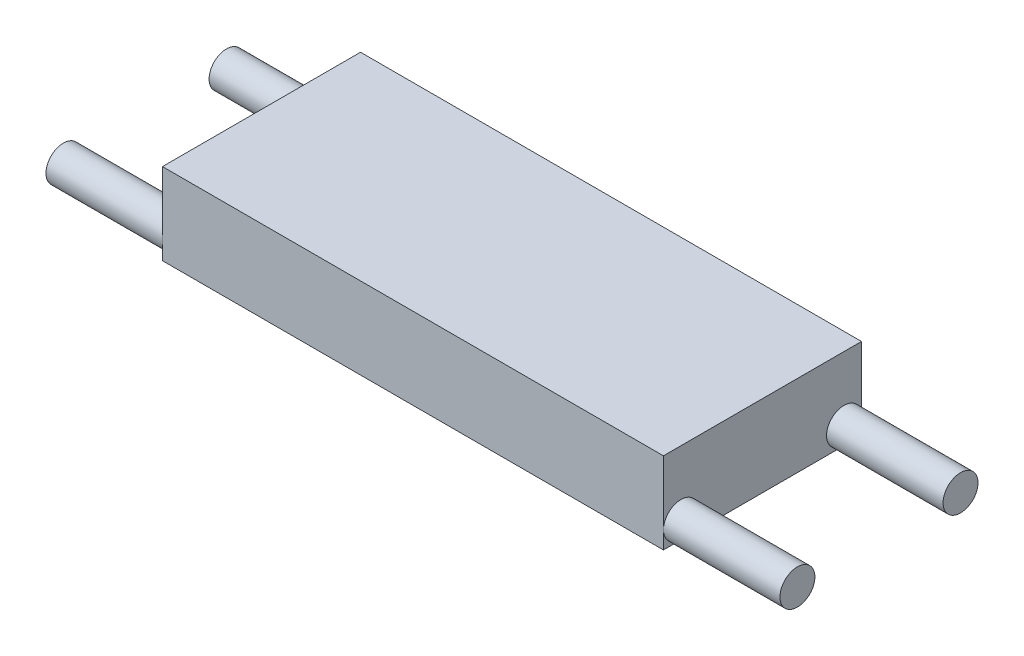
ISO-10303-21;
HEADER;
FILE_DESCRIPTION(('STEP AP214'),'2;1');
FILE_NAME('part.step','',(''),(''),'','','');
FILE_SCHEMA(('AUTOMOTIVE_DESIGN { 1 0 10303 214 1 1 1 1 }'));
ENDSEC;
DATA;
#1=APPLICATION_CONTEXT('core data for automotive mechanical design processes');
#2=APPLICATION_PROTOCOL_DEFINITION('international standard','automotive_design',2000,#1);
#3=PRODUCT_CONTEXT('',#1,'mechanical');
#4=PRODUCT('Part','Part','',(#3));
#5=PRODUCT_RELATED_PRODUCT_CATEGORY('part','',(#4));
#6=PRODUCT_DEFINITION_FORMATION('','',#4);
#7=PRODUCT_DEFINITION_CONTEXT('part definition',#1,'design');
#8=PRODUCT_DEFINITION('design','',#6,#7);
#9=PRODUCT_DEFINITION_SHAPE('','',#8);
#10=(LENGTH_UNIT() NAMED_UNIT(*) SI_UNIT(.MILLI.,.METRE.));
#11=(NAMED_UNIT(*) PLANE_ANGLE_UNIT() SI_UNIT($,.RADIAN.));
#12=(NAMED_UNIT(*) SI_UNIT($,.STERADIAN.) SOLID_ANGLE_UNIT());
#13=UNCERTAINTY_MEASURE_WITH_UNIT(LENGTH_MEASURE(1.E-05),#10,'distance_accuracy_value','');
#14=(GEOMETRIC_REPRESENTATION_CONTEXT(3) GLOBAL_UNCERTAINTY_ASSIGNED_CONTEXT((#13)) GLOBAL_UNIT_ASSIGNED_CONTEXT((#10,
#11,#12)) REPRESENTATION_CONTEXT('',''));
#15=CARTESIAN_POINT('',(0.,0.,0.));
#16=DIRECTION('',(0.,0.,1.));
#17=DIRECTION('',(1.,0.,0.));
#18=AXIS2_PLACEMENT_3D('',#15,#16,#17);
#19=CARTESIAN_POINT('',(0.,7.,0.));
#20=DIRECTION('',(1.,0.,0.));
#21=DIRECTION('',(0.,0.,-1.));
#22=AXIS2_PLACEMENT_3D('',#19,#20,#21);
#23=PLANE('',#22);
#24=DIRECTION('',(0.,-1.,0.));
#25=VECTOR('',#24,1.);
#26=CARTESIAN_POINT('',(0.,7.,0.));
#27=LINE('',#26,#25);
#28=CARTESIAN_POINT('',(0.,1.5,0.));
#29=VERTEX_POINT('',#28);
#30=CARTESIAN_POINT('',(0.,0.,0.));
#31=VERTEX_POINT('',#30);
#32=EDGE_CURVE('E116',#29,#31,#27,.T.);
#33=ORIENTED_EDGE('',*,*,#32,.F.);
#34=CARTESIAN_POINT('',(0.,1.5,-1.5));
#35=DIRECTION('',(1.,0.,0.));
#36=DIRECTION('',(0.,0.,-1.));
#37=AXIS2_PLACEMENT_3D('',#34,#35,#36);
#38=CIRCLE('',#37,1.5);
#39=CARTESIAN_POINT('',(0.,0.,-1.5));
#40=VERTEX_POINT('',#39);
#41=EDGE_CURVE('E57',#29,#40,#38,.T.);
#42=ORIENTED_EDGE('',*,*,#41,.T.);
#43=DIRECTION('',(0.,0.,1.));
#44=VECTOR('',#43,1.);
#45=CARTESIAN_POINT('',(0.,0.,0.));
#46=LINE('',#45,#44);
#47=EDGE_CURVE('E114',#40,#31,#46,.T.);
#48=ORIENTED_EDGE('',*,*,#47,.T.);
#49=EDGE_LOOP('',(#33,#42,#48));
#50=FACE_BOUND('',#49,.T.);
#51=ADVANCED_FACE('F39',(#50),#23,.F.);
#52=CARTESIAN_POINT('',(0.,0.,-15.5));
#53=VERTEX_POINT('',#52);
#54=EDGE_CURVE('E124',#53,#40,#46,.T.);
#55=ORIENTED_EDGE('',*,*,#54,.T.);
#56=EDGE_CURVE('E103',#40,#29,#38,.T.);
#57=ORIENTED_EDGE('',*,*,#56,.T.);
#58=CARTESIAN_POINT('',(0.,7.,0.));
#59=VERTEX_POINT('',#58);
#60=EDGE_CURVE('E43',#59,#29,#27,.T.);
#61=ORIENTED_EDGE('',*,*,#60,.F.);
#62=DIRECTION('',(0.,0.,1.));
#63=VECTOR('',#62,1.);
#64=CARTESIAN_POINT('',(0.,7.,0.));
#65=LINE('',#64,#63);
#66=CARTESIAN_POINT('',(0.,7.,-17.));
#67=VERTEX_POINT('',#66);
#68=EDGE_CURVE('E153',#67,#59,#65,.T.);
#69=ORIENTED_EDGE('',*,*,#68,.F.);
#70=DIRECTION('',(0.,-1.,0.));
#71=VECTOR('',#70,1.);
#72=CARTESIAN_POINT('',(0.,7.,-17.));
#73=LINE('',#72,#71);
#74=CARTESIAN_POINT('',(0.,1.5,-17.));
#75=VERTEX_POINT('',#74);
#76=EDGE_CURVE('E154',#67,#75,#73,.T.);
#77=ORIENTED_EDGE('',*,*,#76,.T.);
#78=CARTESIAN_POINT('',(0.,1.5,-15.5));
#79=DIRECTION('',(1.,0.,0.));
#80=DIRECTION('',(0.,0.,-1.));
#81=AXIS2_PLACEMENT_3D('',#78,#79,#80);
#82=CIRCLE('',#81,1.5);
#83=EDGE_CURVE('E51',#75,#53,#82,.T.);
#84=ORIENTED_EDGE('',*,*,#83,.T.);
#85=EDGE_LOOP('',(#55,#57,#61,#69,#77,#84));
#86=FACE_BOUND('',#85,.T.);
#87=ADVANCED_FACE('F133',(#86),#23,.F.);
#88=CARTESIAN_POINT('',(43.,7.,0.));
#89=DIRECTION('',(-1.,0.,0.));
#90=DIRECTION('',(0.,0.,1.));
#91=AXIS2_PLACEMENT_3D('',#88,#89,#90);
#92=PLANE('',#91);
#93=CARTESIAN_POINT('',(43.,1.5,-1.5));
#94=DIRECTION('',(1.,0.,0.));
#95=DIRECTION('',(0.,0.,-1.));
#96=AXIS2_PLACEMENT_3D('',#93,#94,#95);
#97=CIRCLE('',#96,1.5);
#98=CARTESIAN_POINT('',(43.,1.5,0.));
#99=VERTEX_POINT('',#98);
#100=CARTESIAN_POINT('',(43.,0.,-1.5));
#101=VERTEX_POINT('',#100);
#102=EDGE_CURVE('E174',#99,#101,#97,.T.);
#103=ORIENTED_EDGE('',*,*,#102,.F.);
#104=DIRECTION('',(0.,-1.,0.));
#105=VECTOR('',#104,1.);
#106=CARTESIAN_POINT('',(43.,7.,0.));
#107=LINE('',#106,#105);
#108=CARTESIAN_POINT('',(43.,0.,0.));
#109=VERTEX_POINT('',#108);
#110=EDGE_CURVE('E161',#99,#109,#107,.T.);
#111=ORIENTED_EDGE('',*,*,#110,.T.);
#112=DIRECTION('',(0.,0.,-1.));
#113=VECTOR('',#112,1.);
#114=CARTESIAN_POINT('',(43.,0.,0.));
#115=LINE('',#114,#113);
#116=EDGE_CURVE('E144',#109,#101,#115,.T.);
#117=ORIENTED_EDGE('',*,*,#116,.T.);
#118=EDGE_LOOP('',(#103,#111,#117));
#119=FACE_BOUND('',#118,.T.);
#120=ADVANCED_FACE('F172',(#119),#92,.F.);
#121=EDGE_CURVE('E220',#101,#99,#97,.T.);
#122=ORIENTED_EDGE('',*,*,#121,.F.);
#123=CARTESIAN_POINT('',(43.,0.,-15.5));
#124=VERTEX_POINT('',#123);
#125=EDGE_CURVE('E149',#101,#124,#115,.T.);
#126=ORIENTED_EDGE('',*,*,#125,.T.);
#127=CARTESIAN_POINT('',(43.,1.5,-15.5));
#128=DIRECTION('',(1.,0.,0.));
#129=DIRECTION('',(0.,0.,-1.));
#130=AXIS2_PLACEMENT_3D('',#127,#128,#129);
#131=CIRCLE('',#130,1.5);
#132=CARTESIAN_POINT('',(43.,1.5,-17.));
#133=VERTEX_POINT('',#132);
#134=EDGE_CURVE('E211',#133,#124,#131,.T.);
#135=ORIENTED_EDGE('',*,*,#134,.F.);
#136=DIRECTION('',(0.,-1.,0.));
#137=VECTOR('',#136,1.);
#138=CARTESIAN_POINT('',(43.,7.,-17.));
#139=LINE('',#138,#137);
#140=CARTESIAN_POINT('',(43.,7.,-17.));
#141=VERTEX_POINT('',#140);
#142=EDGE_CURVE('E159',#141,#133,#139,.T.);
#143=ORIENTED_EDGE('',*,*,#142,.F.);
#144=DIRECTION('',(0.,0.,-1.));
#145=VECTOR('',#144,1.);
#146=CARTESIAN_POINT('',(43.,7.,0.));
#147=LINE('',#146,#145);
#148=CARTESIAN_POINT('',(43.,7.,0.));
#149=VERTEX_POINT('',#148);
#150=EDGE_CURVE('E201',#149,#141,#147,.T.);
#151=ORIENTED_EDGE('',*,*,#150,.F.);
#152=EDGE_CURVE('E162',#149,#99,#107,.T.);
#153=ORIENTED_EDGE('',*,*,#152,.T.);
#154=EDGE_LOOP('',(#122,#126,#135,#143,#151,#153));
#155=FACE_BOUND('',#154,.T.);
#156=ADVANCED_FACE('F247',(#155),#92,.F.);
#157=CARTESIAN_POINT('',(0.,0.,-17.));
#158=VERTEX_POINT('',#157);
#159=EDGE_CURVE('E132',#158,#53,#46,.T.);
#160=ORIENTED_EDGE('',*,*,#159,.T.);
#161=EDGE_CURVE('E11',#53,#75,#82,.T.);
#162=ORIENTED_EDGE('',*,*,#161,.T.);
#163=EDGE_CURVE('E158',#75,#158,#73,.T.);
#164=ORIENTED_EDGE('',*,*,#163,.T.);
#165=EDGE_LOOP('',(#160,#162,#164));
#166=FACE_BOUND('',#165,.T.);
#167=ADVANCED_FACE('F41',(#166),#23,.F.);
#168=CARTESIAN_POINT('',(0.,7.,0.));
#169=DIRECTION('',(0.,0.,-1.));
#170=DIRECTION('',(-1.,0.,0.));
#171=AXIS2_PLACEMENT_3D('',#168,#169,#170);
#172=PLANE('',#171);
#173=DIRECTION('',(1.,0.,0.));
#174=VECTOR('',#173,1.);
#175=CARTESIAN_POINT('',(0.,0.,0.));
#176=LINE('',#175,#174);
#177=EDGE_CURVE('E128',#31,#109,#176,.T.);
#178=ORIENTED_EDGE('',*,*,#177,.T.);
#179=ORIENTED_EDGE('',*,*,#110,.F.);
#180=ORIENTED_EDGE('',*,*,#152,.F.);
#181=DIRECTION('',(1.,0.,0.));
#182=VECTOR('',#181,1.);
#183=CARTESIAN_POINT('',(0.,7.,0.));
#184=LINE('',#183,#182);
#185=EDGE_CURVE('E203',#59,#149,#184,.T.);
#186=ORIENTED_EDGE('',*,*,#185,.F.);
#187=ORIENTED_EDGE('',*,*,#60,.T.);
#188=ORIENTED_EDGE('',*,*,#32,.T.);
#189=EDGE_LOOP('',(#178,#179,#180,#186,#187,#188));
#190=FACE_BOUND('',#189,.T.);
#191=ADVANCED_FACE('F177',(#190),#172,.F.);
#192=EDGE_CURVE('E49',#124,#133,#131,.T.);
#193=ORIENTED_EDGE('',*,*,#192,.F.);
#194=CARTESIAN_POINT('',(43.,0.,-17.));
#195=VERTEX_POINT('',#194);
#196=EDGE_CURVE('E143',#124,#195,#115,.T.);
#197=ORIENTED_EDGE('',*,*,#196,.T.);
#198=EDGE_CURVE('E157',#133,#195,#139,.T.);
#199=ORIENTED_EDGE('',*,*,#198,.F.);
#200=EDGE_LOOP('',(#193,#197,#199));
#201=FACE_BOUND('',#200,.T.);
#202=ADVANCED_FACE('F189',(#201),#92,.F.);
#203=CARTESIAN_POINT('',(0.,7.,-17.));
#204=DIRECTION('',(0.,0.,1.));
#205=DIRECTION('',(1.,0.,0.));
#206=AXIS2_PLACEMENT_3D('',#203,#204,#205);
#207=PLANE('',#206);
#208=DIRECTION('',(-1.,0.,0.));
#209=VECTOR('',#208,1.);
#210=CARTESIAN_POINT('',(0.,0.,-17.));
#211=LINE('',#210,#209);
#212=EDGE_CURVE('E148',#195,#158,#211,.T.);
#213=ORIENTED_EDGE('',*,*,#212,.T.);
#214=ORIENTED_EDGE('',*,*,#163,.F.);
#215=ORIENTED_EDGE('',*,*,#76,.F.);
#216=DIRECTION('',(-1.,0.,0.));
#217=VECTOR('',#216,1.);
#218=CARTESIAN_POINT('',(0.,7.,-17.));
#219=LINE('',#218,#217);
#220=EDGE_CURVE('E139',#141,#67,#219,.T.);
#221=ORIENTED_EDGE('',*,*,#220,.F.);
#222=ORIENTED_EDGE('',*,*,#142,.T.);
#223=ORIENTED_EDGE('',*,*,#198,.T.);
#224=EDGE_LOOP('',(#213,#214,#215,#221,#222,#223));
#225=FACE_BOUND('',#224,.T.);
#226=ADVANCED_FACE('F193',(#225),#207,.F.);
#227=CARTESIAN_POINT('',(0.,7.,0.));
#228=DIRECTION('',(0.,-1.,0.));
#229=DIRECTION('',(0.,0.,-1.));
#230=AXIS2_PLACEMENT_3D('',#227,#228,#229);
#231=PLANE('',#230);
#232=ORIENTED_EDGE('',*,*,#68,.T.);
#233=ORIENTED_EDGE('',*,*,#185,.T.);
#234=ORIENTED_EDGE('',*,*,#150,.T.);
#235=ORIENTED_EDGE('',*,*,#220,.T.);
#236=EDGE_LOOP('',(#232,#233,#234,#235));
#237=FACE_BOUND('',#236,.T.);
#238=ADVANCED_FACE('F280',(#237),#231,.F.);
#239=CARTESIAN_POINT('',(0.,0.,0.));
#240=DIRECTION('',(0.,-1.,0.));
#241=DIRECTION('',(0.,0.,-1.));
#242=AXIS2_PLACEMENT_3D('',#239,#240,#241);
#243=PLANE('',#242);
#244=ORIENTED_EDGE('',*,*,#159,.F.);
#245=ORIENTED_EDGE('',*,*,#212,.F.);
#246=ORIENTED_EDGE('',*,*,#196,.F.);
#247=ORIENTED_EDGE('',*,*,#125,.F.);
#248=ORIENTED_EDGE('',*,*,#116,.F.);
#249=ORIENTED_EDGE('',*,*,#177,.F.);
#250=ORIENTED_EDGE('',*,*,#47,.F.);
#251=ORIENTED_EDGE('',*,*,#54,.F.);
#252=EDGE_LOOP('',(#244,#245,#246,#247,#248,#249,#250,#251));
#253=FACE_BOUND('',#252,.T.);
#254=ADVANCED_FACE('F123',(#253),#243,.T.);
#255=CARTESIAN_POINT('',(53.,1.5,-15.5));
#256=DIRECTION('',(-1.,0.,0.));
#257=DIRECTION('',(0.,0.,1.));
#258=AXIS2_PLACEMENT_3D('',#255,#256,#257);
#259=CYLINDRICAL_SURFACE('',#258,1.5);
#260=CARTESIAN_POINT('',(53.,1.5,-15.5));
#261=DIRECTION('',(1.,0.,0.));
#262=DIRECTION('',(0.,0.,-1.));
#263=AXIS2_PLACEMENT_3D('',#260,#261,#262);
#264=CIRCLE('',#263,1.5);
#265=CARTESIAN_POINT('',(53.,1.5,-17.));
#266=VERTEX_POINT('',#265);
#267=EDGE_CURVE('E130',#266,#266,#264,.T.);
#268=ORIENTED_EDGE('',*,*,#267,.F.);
#269=EDGE_LOOP('',(#268));
#270=FACE_BOUND('',#269,.T.);
#271=ORIENTED_EDGE('',*,*,#134,.T.);
#272=ORIENTED_EDGE('',*,*,#192,.T.);
#273=EDGE_LOOP('',(#271,#272));
#274=FACE_BOUND('',#273,.T.);
#275=ADVANCED_FACE('F275',(#270,#274),#259,.T.);
#276=CARTESIAN_POINT('',(53.,1.5,-15.5));
#277=DIRECTION('',(1.,0.,0.));
#278=DIRECTION('',(0.,0.,-1.));
#279=AXIS2_PLACEMENT_3D('',#276,#277,#278);
#280=PLANE('',#279);
#281=ORIENTED_EDGE('',*,*,#267,.T.);
#282=EDGE_LOOP('',(#281));
#283=FACE_BOUND('',#282,.T.);
#284=ADVANCED_FACE('F271',(#283),#280,.T.);
#285=CARTESIAN_POINT('',(53.,1.5,-1.5));
#286=DIRECTION('',(-1.,0.,0.));
#287=DIRECTION('',(0.,0.,1.));
#288=AXIS2_PLACEMENT_3D('',#285,#286,#287);
#289=CYLINDRICAL_SURFACE('',#288,1.5);
#290=CARTESIAN_POINT('',(53.,1.5,-1.5));
#291=DIRECTION('',(1.,0.,0.));
#292=DIRECTION('',(0.,0.,-1.));
#293=AXIS2_PLACEMENT_3D('',#290,#291,#292);
#294=CIRCLE('',#293,1.5);
#295=CARTESIAN_POINT('',(53.,1.5,-3.));
#296=VERTEX_POINT('',#295);
#297=EDGE_CURVE('E214',#296,#296,#294,.T.);
#298=ORIENTED_EDGE('',*,*,#297,.F.);
#299=EDGE_LOOP('',(#298));
#300=FACE_BOUND('',#299,.T.);
#301=ORIENTED_EDGE('',*,*,#102,.T.);
#302=ORIENTED_EDGE('',*,*,#121,.T.);
#303=EDGE_LOOP('',(#301,#302));
#304=FACE_BOUND('',#303,.T.);
#305=ADVANCED_FACE('F265',(#300,#304),#289,.T.);
#306=CARTESIAN_POINT('',(53.,1.5,-1.5));
#307=DIRECTION('',(1.,0.,0.));
#308=DIRECTION('',(0.,0.,-1.));
#309=AXIS2_PLACEMENT_3D('',#306,#307,#308);
#310=PLANE('',#309);
#311=ORIENTED_EDGE('',*,*,#297,.T.);
#312=EDGE_LOOP('',(#311));
#313=FACE_BOUND('',#312,.T.);
#314=ADVANCED_FACE('F256',(#313),#310,.T.);
#315=CARTESIAN_POINT('',(-10.,1.5,-15.5));
#316=DIRECTION('',(1.,0.,0.));
#317=DIRECTION('',(0.,0.,-1.));
#318=AXIS2_PLACEMENT_3D('',#315,#316,#317);
#319=CYLINDRICAL_SURFACE('',#318,1.5);
#320=CARTESIAN_POINT('',(-10.,1.5,-15.5));
#321=DIRECTION('',(1.,0.,0.));
#322=DIRECTION('',(0.,0.,-1.));
#323=AXIS2_PLACEMENT_3D('',#320,#321,#322);
#324=CIRCLE('',#323,1.5);
#325=CARTESIAN_POINT('',(-10.,1.5,-17.));
#326=VERTEX_POINT('',#325);
#327=EDGE_CURVE('E225',#326,#326,#324,.T.);
#328=ORIENTED_EDGE('',*,*,#327,.T.);
#329=EDGE_LOOP('',(#328));
#330=FACE_BOUND('',#329,.T.);
#331=ORIENTED_EDGE('',*,*,#83,.F.);
#332=ORIENTED_EDGE('',*,*,#161,.F.);
#333=EDGE_LOOP('',(#331,#332));
#334=FACE_BOUND('',#333,.T.);
#335=ADVANCED_FACE('F254',(#330,#334),#319,.T.);
#336=CARTESIAN_POINT('',(-10.,1.5,-15.5));
#337=DIRECTION('',(-1.,0.,0.));
#338=DIRECTION('',(0.,0.,-1.));
#339=AXIS2_PLACEMENT_3D('',#336,#337,#338);
#340=PLANE('',#339);
#341=ORIENTED_EDGE('',*,*,#327,.F.);
#342=EDGE_LOOP('',(#341));
#343=FACE_BOUND('',#342,.T.);
#344=ADVANCED_FACE('F240',(#343),#340,.T.);
#345=CARTESIAN_POINT('',(-10.,1.5,-1.5));
#346=DIRECTION('',(1.,0.,0.));
#347=DIRECTION('',(0.,0.,-1.));
#348=AXIS2_PLACEMENT_3D('',#345,#346,#347);
#349=CYLINDRICAL_SURFACE('',#348,1.5);
#350=CARTESIAN_POINT('',(-10.,1.5,-1.5));
#351=DIRECTION('',(1.,0.,0.));
#352=DIRECTION('',(0.,0.,-1.));
#353=AXIS2_PLACEMENT_3D('',#350,#351,#352);
#354=CIRCLE('',#353,1.5);
#355=CARTESIAN_POINT('',(-10.,1.5,-3.));
#356=VERTEX_POINT('',#355);
#357=EDGE_CURVE('E119',#356,#356,#354,.T.);
#358=ORIENTED_EDGE('',*,*,#357,.T.);
#359=EDGE_LOOP('',(#358));
#360=FACE_BOUND('',#359,.T.);
#361=ORIENTED_EDGE('',*,*,#41,.F.);
#362=ORIENTED_EDGE('',*,*,#56,.F.);
#363=EDGE_LOOP('',(#361,#362));
#364=FACE_BOUND('',#363,.T.);
#365=ADVANCED_FACE('F104',(#360,#364),#349,.T.);
#366=CARTESIAN_POINT('',(-10.,1.5,-1.5));
#367=DIRECTION('',(-1.,0.,0.));
#368=DIRECTION('',(0.,0.,-1.));
#369=AXIS2_PLACEMENT_3D('',#366,#367,#368);
#370=PLANE('',#369);
#371=ORIENTED_EDGE('',*,*,#357,.F.);
#372=EDGE_LOOP('',(#371));
#373=FACE_BOUND('',#372,.T.);
#374=ADVANCED_FACE('F234',(#373),#370,.T.);
#375=CLOSED_SHELL('',(#51,#87,#120,#156,#167,#191,#202,#226,#238,#254,#275,#284,#305,#314,#335,
#344,#365,#374));
#376=MANIFOLD_SOLID_BREP('B2',#375);
#377=ADVANCED_BREP_SHAPE_REPRESENTATION('',(#18,#376),#14);
#378=SHAPE_DEFINITION_REPRESENTATION(#9,#377);
ENDSEC;
END-ISO-10303-21;
